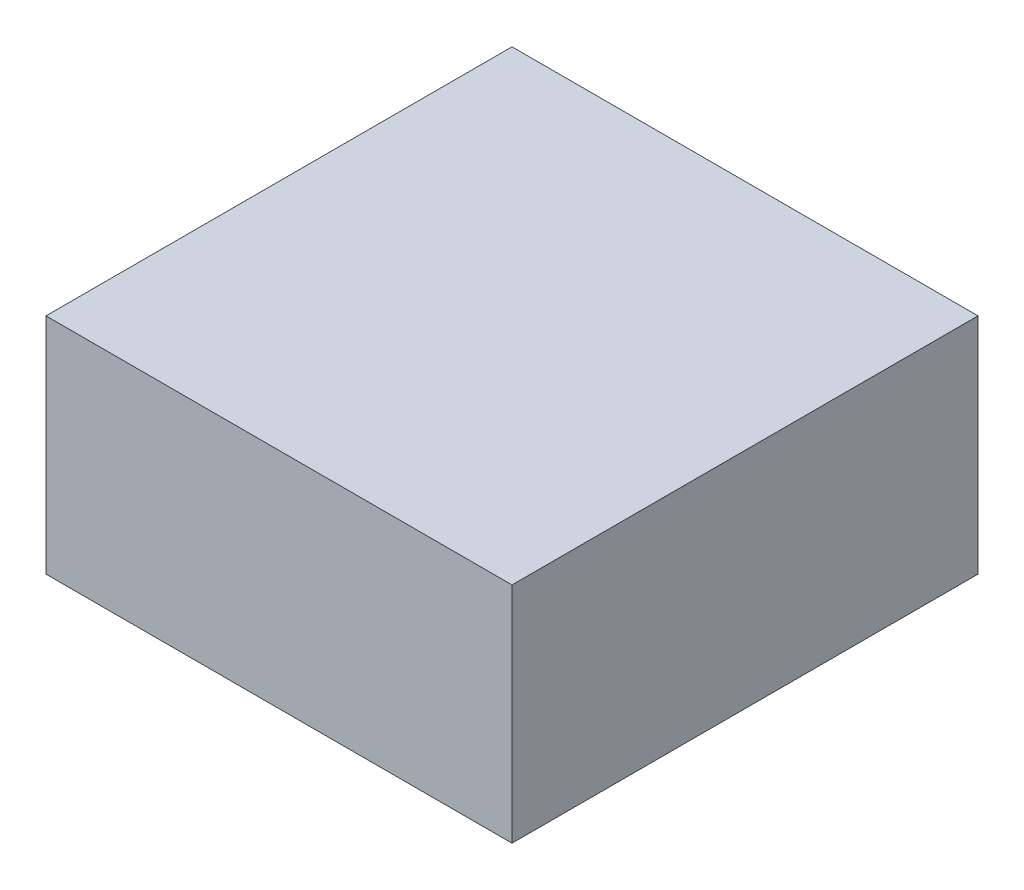
ISO-10303-21;
HEADER;
FILE_DESCRIPTION(('STEP AP214'),'2;1');
FILE_NAME('part.step','',(''),(''),'','','');
FILE_SCHEMA(('AUTOMOTIVE_DESIGN { 1 0 10303 214 1 1 1 1 }'));
ENDSEC;
DATA;
#1=APPLICATION_CONTEXT('core data for automotive mechanical design processes');
#2=APPLICATION_PROTOCOL_DEFINITION('international standard','automotive_design',2000,#1);
#3=PRODUCT_CONTEXT('',#1,'mechanical');
#4=PRODUCT('Part','Part','',(#3));
#5=PRODUCT_RELATED_PRODUCT_CATEGORY('part','',(#4));
#6=PRODUCT_DEFINITION_FORMATION('','',#4);
#7=PRODUCT_DEFINITION_CONTEXT('part definition',#1,'design');
#8=PRODUCT_DEFINITION('design','',#6,#7);
#9=PRODUCT_DEFINITION_SHAPE('','',#8);
#10=(LENGTH_UNIT() NAMED_UNIT(*) SI_UNIT(.MILLI.,.METRE.));
#11=(NAMED_UNIT(*) PLANE_ANGLE_UNIT() SI_UNIT($,.RADIAN.));
#12=(NAMED_UNIT(*) SI_UNIT($,.STERADIAN.) SOLID_ANGLE_UNIT());
#13=UNCERTAINTY_MEASURE_WITH_UNIT(LENGTH_MEASURE(1.E-05),#10,'distance_accuracy_value','');
#14=(GEOMETRIC_REPRESENTATION_CONTEXT(3) GLOBAL_UNCERTAINTY_ASSIGNED_CONTEXT((#13)) GLOBAL_UNIT_ASSIGNED_CONTEXT((#10,
#11,#12)) REPRESENTATION_CONTEXT('',''));
#15=CARTESIAN_POINT('',(0.,0.,0.));
#16=DIRECTION('',(0.,0.,1.));
#17=DIRECTION('',(1.,0.,0.));
#18=AXIS2_PLACEMENT_3D('',#15,#16,#17);
#19=CARTESIAN_POINT('',(-125.,120.,125.));
#20=DIRECTION('',(1.,0.,0.));
#21=DIRECTION('',(0.,0.,-1.));
#22=AXIS2_PLACEMENT_3D('',#19,#20,#21);
#23=PLANE('',#22);
#24=DIRECTION('',(0.,0.,1.));
#25=VECTOR('',#24,1.);
#26=CARTESIAN_POINT('',(-125.,0.,125.));
#27=LINE('',#26,#25);
#28=CARTESIAN_POINT('',(-125.,0.,-125.));
#29=VERTEX_POINT('',#28);
#30=CARTESIAN_POINT('',(-125.,0.,125.));
#31=VERTEX_POINT('',#30);
#32=EDGE_CURVE('E99',#29,#31,#27,.T.);
#33=ORIENTED_EDGE('',*,*,#32,.T.);
#34=DIRECTION('',(0.,-1.,0.));
#35=VECTOR('',#34,1.);
#36=CARTESIAN_POINT('',(-125.,120.,125.));
#37=LINE('',#36,#35);
#38=CARTESIAN_POINT('',(-125.,120.,125.));
#39=VERTEX_POINT('',#38);
#40=EDGE_CURVE('E11',#39,#31,#37,.T.);
#41=ORIENTED_EDGE('',*,*,#40,.F.);
#42=DIRECTION('',(0.,0.,1.));
#43=VECTOR('',#42,1.);
#44=CARTESIAN_POINT('',(-125.,120.,125.));
#45=LINE('',#44,#43);
#46=CARTESIAN_POINT('',(-125.,120.,-125.));
#47=VERTEX_POINT('',#46);
#48=EDGE_CURVE('E87',#47,#39,#45,.T.);
#49=ORIENTED_EDGE('',*,*,#48,.F.);
#50=DIRECTION('',(0.,-1.,0.));
#51=VECTOR('',#50,1.);
#52=CARTESIAN_POINT('',(-125.,120.,-125.));
#53=LINE('',#52,#51);
#54=EDGE_CURVE('E95',#47,#29,#53,.T.);
#55=ORIENTED_EDGE('',*,*,#54,.T.);
#56=EDGE_LOOP('',(#33,#41,#49,#55));
#57=FACE_BOUND('',#56,.T.);
#58=ADVANCED_FACE('F36',(#57),#23,.F.);
#59=CARTESIAN_POINT('',(125.,120.,125.));
#60=DIRECTION('',(0.,0.,-1.));
#61=DIRECTION('',(-1.,0.,0.));
#62=AXIS2_PLACEMENT_3D('',#59,#60,#61);
#63=PLANE('',#62);
#64=DIRECTION('',(1.,0.,0.));
#65=VECTOR('',#64,1.);
#66=CARTESIAN_POINT('',(125.,0.,125.));
#67=LINE('',#66,#65);
#68=CARTESIAN_POINT('',(125.,0.,125.));
#69=VERTEX_POINT('',#68);
#70=EDGE_CURVE('E91',#31,#69,#67,.T.);
#71=ORIENTED_EDGE('',*,*,#70,.T.);
#72=DIRECTION('',(0.,-1.,0.));
#73=VECTOR('',#72,1.);
#74=CARTESIAN_POINT('',(125.,120.,125.));
#75=LINE('',#74,#73);
#76=CARTESIAN_POINT('',(125.,120.,125.));
#77=VERTEX_POINT('',#76);
#78=EDGE_CURVE('E44',#77,#69,#75,.T.);
#79=ORIENTED_EDGE('',*,*,#78,.F.);
#80=DIRECTION('',(1.,0.,0.));
#81=VECTOR('',#80,1.);
#82=CARTESIAN_POINT('',(125.,120.,125.));
#83=LINE('',#82,#81);
#84=EDGE_CURVE('E82',#39,#77,#83,.T.);
#85=ORIENTED_EDGE('',*,*,#84,.F.);
#86=ORIENTED_EDGE('',*,*,#40,.T.);
#87=EDGE_LOOP('',(#71,#79,#85,#86));
#88=FACE_BOUND('',#87,.T.);
#89=ADVANCED_FACE('F90',(#88),#63,.F.);
#90=CARTESIAN_POINT('',(125.,120.,125.));
#91=DIRECTION('',(-1.,0.,0.));
#92=DIRECTION('',(0.,0.,1.));
#93=AXIS2_PLACEMENT_3D('',#90,#91,#92);
#94=PLANE('',#93);
#95=DIRECTION('',(0.,0.,-1.));
#96=VECTOR('',#95,1.);
#97=CARTESIAN_POINT('',(125.,0.,125.));
#98=LINE('',#97,#96);
#99=CARTESIAN_POINT('',(125.,0.,-125.));
#100=VERTEX_POINT('',#99);
#101=EDGE_CURVE('E69',#69,#100,#98,.T.);
#102=ORIENTED_EDGE('',*,*,#101,.T.);
#103=DIRECTION('',(0.,-1.,0.));
#104=VECTOR('',#103,1.);
#105=CARTESIAN_POINT('',(125.,120.,-125.));
#106=LINE('',#105,#104);
#107=CARTESIAN_POINT('',(125.,120.,-125.));
#108=VERTEX_POINT('',#107);
#109=EDGE_CURVE('E92',#108,#100,#106,.T.);
#110=ORIENTED_EDGE('',*,*,#109,.F.);
#111=DIRECTION('',(0.,0.,-1.));
#112=VECTOR('',#111,1.);
#113=CARTESIAN_POINT('',(125.,120.,125.));
#114=LINE('',#113,#112);
#115=EDGE_CURVE('E85',#77,#108,#114,.T.);
#116=ORIENTED_EDGE('',*,*,#115,.F.);
#117=ORIENTED_EDGE('',*,*,#78,.T.);
#118=EDGE_LOOP('',(#102,#110,#116,#117));
#119=FACE_BOUND('',#118,.T.);
#120=ADVANCED_FACE('F93',(#119),#94,.F.);
#121=CARTESIAN_POINT('',(125.,120.,-125.));
#122=DIRECTION('',(0.,0.,1.));
#123=DIRECTION('',(1.,0.,0.));
#124=AXIS2_PLACEMENT_3D('',#121,#122,#123);
#125=PLANE('',#124);
#126=DIRECTION('',(-1.,0.,0.));
#127=VECTOR('',#126,1.);
#128=CARTESIAN_POINT('',(125.,0.,-125.));
#129=LINE('',#128,#127);
#130=EDGE_CURVE('E75',#100,#29,#129,.T.);
#131=ORIENTED_EDGE('',*,*,#130,.T.);
#132=ORIENTED_EDGE('',*,*,#54,.F.);
#133=DIRECTION('',(-1.,0.,0.));
#134=VECTOR('',#133,1.);
#135=CARTESIAN_POINT('',(125.,120.,-125.));
#136=LINE('',#135,#134);
#137=EDGE_CURVE('E52',#108,#47,#136,.T.);
#138=ORIENTED_EDGE('',*,*,#137,.F.);
#139=ORIENTED_EDGE('',*,*,#109,.T.);
#140=EDGE_LOOP('',(#131,#132,#138,#139));
#141=FACE_BOUND('',#140,.T.);
#142=ADVANCED_FACE('F106',(#141),#125,.F.);
#143=CARTESIAN_POINT('',(0.,120.,0.));
#144=DIRECTION('',(0.,1.,0.));
#145=DIRECTION('',(0.,0.,1.));
#146=AXIS2_PLACEMENT_3D('',#143,#144,#145);
#147=PLANE('',#146);
#148=ORIENTED_EDGE('',*,*,#48,.T.);
#149=ORIENTED_EDGE('',*,*,#84,.T.);
#150=ORIENTED_EDGE('',*,*,#115,.T.);
#151=ORIENTED_EDGE('',*,*,#137,.T.);
#152=EDGE_LOOP('',(#148,#149,#150,#151));
#153=FACE_BOUND('',#152,.T.);
#154=ADVANCED_FACE('F83',(#153),#147,.T.);
#155=CARTESIAN_POINT('',(0.,0.,0.));
#156=DIRECTION('',(0.,1.,0.));
#157=DIRECTION('',(0.,0.,1.));
#158=AXIS2_PLACEMENT_3D('',#155,#156,#157);
#159=PLANE('',#158);
#160=ORIENTED_EDGE('',*,*,#32,.F.);
#161=ORIENTED_EDGE('',*,*,#130,.F.);
#162=ORIENTED_EDGE('',*,*,#101,.F.);
#163=ORIENTED_EDGE('',*,*,#70,.F.);
#164=EDGE_LOOP('',(#160,#161,#162,#163));
#165=FACE_BOUND('',#164,.T.);
#166=ADVANCED_FACE('F109',(#165),#159,.F.);
#167=CLOSED_SHELL('',(#58,#89,#120,#142,#154,#166));
#168=MANIFOLD_SOLID_BREP('B2',#167);
#169=ADVANCED_BREP_SHAPE_REPRESENTATION('',(#18,#168),#14);
#170=SHAPE_DEFINITION_REPRESENTATION(#9,#169);
ENDSEC;
END-ISO-10303-21;
